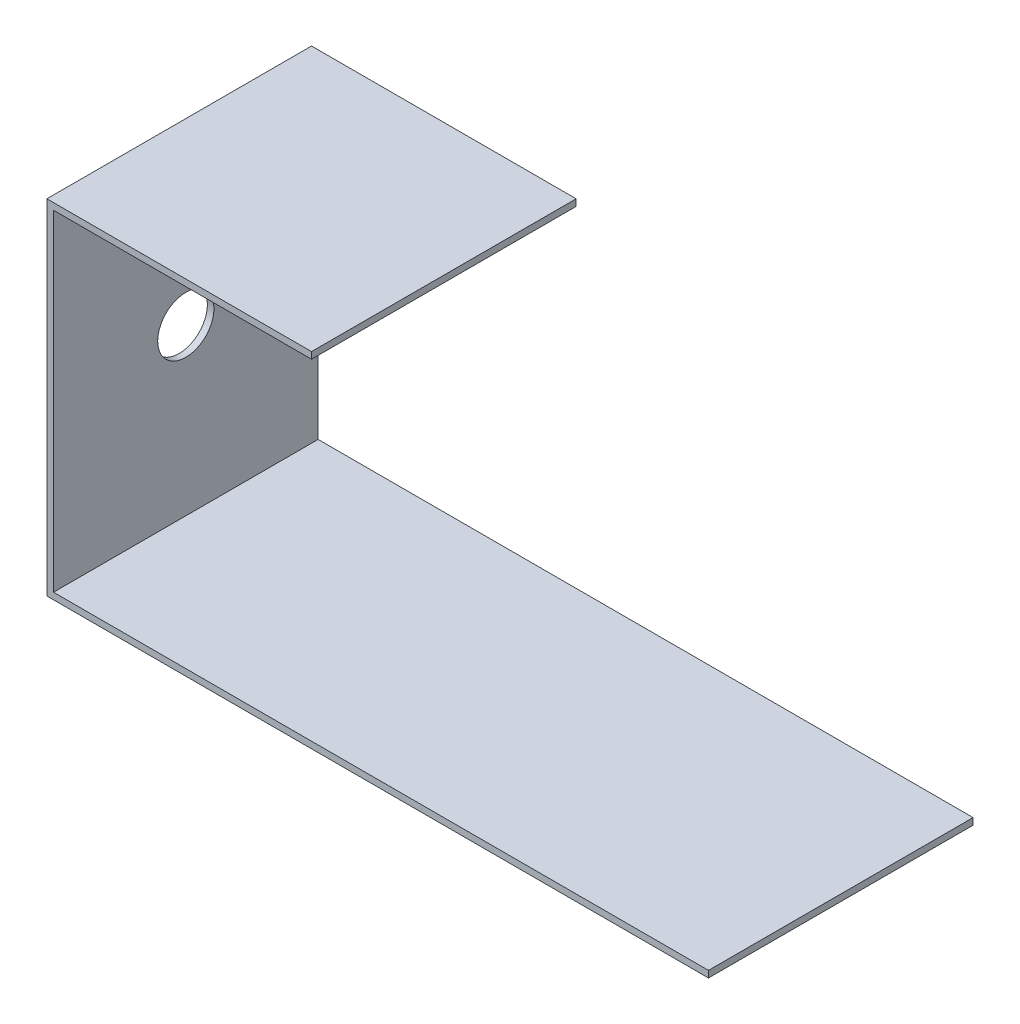
ISO-10303-21;
HEADER;
FILE_DESCRIPTION(('STEP AP214'),'2;1');
FILE_NAME('part.step','',(''),(''),'','','');
FILE_SCHEMA(('AUTOMOTIVE_DESIGN { 1 0 10303 214 1 1 1 1 }'));
ENDSEC;
DATA;
#1=APPLICATION_CONTEXT('core data for automotive mechanical design processes');
#2=APPLICATION_PROTOCOL_DEFINITION('international standard','automotive_design',2000,#1);
#3=PRODUCT_CONTEXT('',#1,'mechanical');
#4=PRODUCT('Part','Part','',(#3));
#5=PRODUCT_RELATED_PRODUCT_CATEGORY('part','',(#4));
#6=PRODUCT_DEFINITION_FORMATION('','',#4);
#7=PRODUCT_DEFINITION_CONTEXT('part definition',#1,'design');
#8=PRODUCT_DEFINITION('design','',#6,#7);
#9=PRODUCT_DEFINITION_SHAPE('','',#8);
#10=(LENGTH_UNIT() NAMED_UNIT(*) SI_UNIT(.MILLI.,.METRE.));
#11=(NAMED_UNIT(*) PLANE_ANGLE_UNIT() SI_UNIT($,.RADIAN.));
#12=(NAMED_UNIT(*) SI_UNIT($,.STERADIAN.) SOLID_ANGLE_UNIT());
#13=UNCERTAINTY_MEASURE_WITH_UNIT(LENGTH_MEASURE(1.E-05),#10,'distance_accuracy_value','');
#14=(GEOMETRIC_REPRESENTATION_CONTEXT(3) GLOBAL_UNCERTAINTY_ASSIGNED_CONTEXT((#13)) GLOBAL_UNIT_ASSIGNED_CONTEXT((#10,
#11,#12)) REPRESENTATION_CONTEXT('',''));
#15=CARTESIAN_POINT('',(0.,0.,0.));
#16=DIRECTION('',(0.,0.,1.));
#17=DIRECTION('',(1.,0.,0.));
#18=AXIS2_PLACEMENT_3D('',#15,#16,#17);
#19=CARTESIAN_POINT('',(0.,-52.,40.));
#20=DIRECTION('',(1.,0.,0.));
#21=DIRECTION('',(0.,0.,-1.));
#22=AXIS2_PLACEMENT_3D('',#19,#20,#21);
#23=PLANE('',#22);
#24=CARTESIAN_POINT('',(0.,-26.,20.));
#25=DIRECTION('',(-1.,0.,0.));
#26=DIRECTION('',(0.,0.,1.));
#27=AXIS2_PLACEMENT_3D('',#24,#25,#26);
#28=CIRCLE('',#27,4.25);
#29=CARTESIAN_POINT('',(0.,-26.,24.25));
#30=VERTEX_POINT('',#29);
#31=EDGE_CURVE('E206',#30,#30,#28,.T.);
#32=ORIENTED_EDGE('',*,*,#31,.F.);
#33=EDGE_LOOP('',(#32));
#34=FACE_BOUND('',#33,.T.);
#35=DIRECTION('',(0.,-1.,0.));
#36=VECTOR('',#35,1.);
#37=CARTESIAN_POINT('',(0.,-52.,0.));
#38=LINE('',#37,#36);
#39=CARTESIAN_POINT('',(0.,0.,0.));
#40=VERTEX_POINT('',#39);
#41=CARTESIAN_POINT('',(0.,-52.,0.));
#42=VERTEX_POINT('',#41);
#43=EDGE_CURVE('E139',#40,#42,#38,.T.);
#44=ORIENTED_EDGE('',*,*,#43,.T.);
#45=DIRECTION('',(0.,0.,-1.));
#46=VECTOR('',#45,1.);
#47=CARTESIAN_POINT('',(0.,-52.,40.));
#48=LINE('',#47,#46);
#49=CARTESIAN_POINT('',(0.,-52.,40.));
#50=VERTEX_POINT('',#49);
#51=EDGE_CURVE('E11',#50,#42,#48,.T.);
#52=ORIENTED_EDGE('',*,*,#51,.F.);
#53=DIRECTION('',(0.,-1.,0.));
#54=VECTOR('',#53,1.);
#55=CARTESIAN_POINT('',(0.,-52.,40.));
#56=LINE('',#55,#54);
#57=CARTESIAN_POINT('',(0.,0.,40.));
#58=VERTEX_POINT('',#57);
#59=EDGE_CURVE('E162',#58,#50,#56,.T.);
#60=ORIENTED_EDGE('',*,*,#59,.F.);
#61=DIRECTION('',(0.,0.,-1.));
#62=VECTOR('',#61,1.);
#63=CARTESIAN_POINT('',(0.,0.,40.));
#64=LINE('',#63,#62);
#65=EDGE_CURVE('E135',#58,#40,#64,.T.);
#66=ORIENTED_EDGE('',*,*,#65,.T.);
#67=EDGE_LOOP('',(#44,#52,#60,#66));
#68=FACE_BOUND('',#67,.T.);
#69=ADVANCED_FACE('F38',(#34,#68),#23,.F.);
#70=CARTESIAN_POINT('',(100.,-52.,40.));
#71=DIRECTION('',(0.,1.,0.));
#72=DIRECTION('',(-1.,0.,0.));
#73=AXIS2_PLACEMENT_3D('',#70,#71,#72);
#74=PLANE('',#73);
#75=DIRECTION('',(1.,0.,0.));
#76=VECTOR('',#75,1.);
#77=CARTESIAN_POINT('',(100.,-52.,0.));
#78=LINE('',#77,#76);
#79=CARTESIAN_POINT('',(100.,-52.,0.));
#80=VERTEX_POINT('',#79);
#81=EDGE_CURVE('E143',#42,#80,#78,.T.);
#82=ORIENTED_EDGE('',*,*,#81,.T.);
#83=DIRECTION('',(0.,0.,-1.));
#84=VECTOR('',#83,1.);
#85=CARTESIAN_POINT('',(100.,-52.,40.));
#86=LINE('',#85,#84);
#87=CARTESIAN_POINT('',(100.,-52.,40.));
#88=VERTEX_POINT('',#87);
#89=EDGE_CURVE('E47',#88,#80,#86,.T.);
#90=ORIENTED_EDGE('',*,*,#89,.F.);
#91=DIRECTION('',(1.,0.,0.));
#92=VECTOR('',#91,1.);
#93=CARTESIAN_POINT('',(100.,-52.,40.));
#94=LINE('',#93,#92);
#95=EDGE_CURVE('E98',#50,#88,#94,.T.);
#96=ORIENTED_EDGE('',*,*,#95,.F.);
#97=ORIENTED_EDGE('',*,*,#51,.T.);
#98=EDGE_LOOP('',(#82,#90,#96,#97));
#99=FACE_BOUND('',#98,.T.);
#100=ADVANCED_FACE('F223',(#99),#74,.F.);
#101=CARTESIAN_POINT('',(100.,-51.,40.));
#102=DIRECTION('',(-1.,0.,0.));
#103=DIRECTION('',(0.,0.,1.));
#104=AXIS2_PLACEMENT_3D('',#101,#102,#103);
#105=PLANE('',#104);
#106=DIRECTION('',(0.,1.,0.));
#107=VECTOR('',#106,1.);
#108=CARTESIAN_POINT('',(100.,-51.,0.));
#109=LINE('',#108,#107);
#110=CARTESIAN_POINT('',(100.,-51.,0.));
#111=VERTEX_POINT('',#110);
#112=EDGE_CURVE('E147',#80,#111,#109,.T.);
#113=ORIENTED_EDGE('',*,*,#112,.T.);
#114=DIRECTION('',(0.,0.,-1.));
#115=VECTOR('',#114,1.);
#116=CARTESIAN_POINT('',(100.,-51.,40.));
#117=LINE('',#116,#115);
#118=CARTESIAN_POINT('',(100.,-51.,40.));
#119=VERTEX_POINT('',#118);
#120=EDGE_CURVE('E173',#119,#111,#117,.T.);
#121=ORIENTED_EDGE('',*,*,#120,.F.);
#122=DIRECTION('',(0.,1.,0.));
#123=VECTOR('',#122,1.);
#124=CARTESIAN_POINT('',(100.,-51.,40.));
#125=LINE('',#124,#123);
#126=EDGE_CURVE('E183',#88,#119,#125,.T.);
#127=ORIENTED_EDGE('',*,*,#126,.F.);
#128=ORIENTED_EDGE('',*,*,#89,.T.);
#129=EDGE_LOOP('',(#113,#121,#127,#128));
#130=FACE_BOUND('',#129,.T.);
#131=ADVANCED_FACE('F181',(#130),#105,.F.);
#132=CARTESIAN_POINT('',(1.00000000000001,-51.,40.));
#133=DIRECTION('',(0.,-1.,0.));
#134=DIRECTION('',(0.,0.,-1.));
#135=AXIS2_PLACEMENT_3D('',#132,#133,#134);
#136=PLANE('',#135);
#137=DIRECTION('',(-1.,0.,0.));
#138=VECTOR('',#137,1.);
#139=CARTESIAN_POINT('',(1.00000000000001,-51.,0.));
#140=LINE('',#139,#138);
#141=CARTESIAN_POINT('',(1.00000000000001,-51.,0.));
#142=VERTEX_POINT('',#141);
#143=EDGE_CURVE('E150',#111,#142,#140,.T.);
#144=ORIENTED_EDGE('',*,*,#143,.T.);
#145=DIRECTION('',(0.,0.,-1.));
#146=VECTOR('',#145,1.);
#147=CARTESIAN_POINT('',(1.00000000000001,-51.,40.));
#148=LINE('',#147,#146);
#149=CARTESIAN_POINT('',(1.00000000000001,-51.,40.));
#150=VERTEX_POINT('',#149);
#151=EDGE_CURVE('E169',#150,#142,#148,.T.);
#152=ORIENTED_EDGE('',*,*,#151,.F.);
#153=DIRECTION('',(-1.,0.,0.));
#154=VECTOR('',#153,1.);
#155=CARTESIAN_POINT('',(1.00000000000001,-51.,40.));
#156=LINE('',#155,#154);
#157=EDGE_CURVE('E196',#119,#150,#156,.T.);
#158=ORIENTED_EDGE('',*,*,#157,.F.);
#159=ORIENTED_EDGE('',*,*,#120,.T.);
#160=EDGE_LOOP('',(#144,#152,#158,#159));
#161=FACE_BOUND('',#160,.T.);
#162=ADVANCED_FACE('F191',(#161),#136,.F.);
#163=CARTESIAN_POINT('',(0.999999999999997,-1.,40.));
#164=DIRECTION('',(-1.,0.,0.));
#165=DIRECTION('',(0.,-1.,0.));
#166=AXIS2_PLACEMENT_3D('',#163,#164,#165);
#167=PLANE('',#166);
#168=CARTESIAN_POINT('',(1.,-26.,20.));
#169=DIRECTION('',(-1.,0.,0.));
#170=DIRECTION('',(0.,0.,1.));
#171=AXIS2_PLACEMENT_3D('',#168,#169,#170);
#172=CIRCLE('',#171,4.25);
#173=CARTESIAN_POINT('',(1.,-26.,24.25));
#174=VERTEX_POINT('',#173);
#175=EDGE_CURVE('E144',#174,#174,#172,.T.);
#176=ORIENTED_EDGE('',*,*,#175,.T.);
#177=EDGE_LOOP('',(#176));
#178=FACE_BOUND('',#177,.T.);
#179=DIRECTION('',(0.,1.,0.));
#180=VECTOR('',#179,1.);
#181=CARTESIAN_POINT('',(0.999999999999997,-1.,0.));
#182=LINE('',#181,#180);
#183=CARTESIAN_POINT('',(0.999999999999997,-1.,0.));
#184=VERTEX_POINT('',#183);
#185=EDGE_CURVE('E153',#142,#184,#182,.T.);
#186=ORIENTED_EDGE('',*,*,#185,.T.);
#187=DIRECTION('',(0.,0.,-1.));
#188=VECTOR('',#187,1.);
#189=CARTESIAN_POINT('',(0.999999999999997,-1.,40.));
#190=LINE('',#189,#188);
#191=CARTESIAN_POINT('',(0.999999999999997,-1.,40.));
#192=VERTEX_POINT('',#191);
#193=EDGE_CURVE('E128',#192,#184,#190,.T.);
#194=ORIENTED_EDGE('',*,*,#193,.F.);
#195=DIRECTION('',(0.,1.,0.));
#196=VECTOR('',#195,1.);
#197=CARTESIAN_POINT('',(0.999999999999997,-1.,40.));
#198=LINE('',#197,#196);
#199=EDGE_CURVE('E117',#150,#192,#198,.T.);
#200=ORIENTED_EDGE('',*,*,#199,.F.);
#201=ORIENTED_EDGE('',*,*,#151,.T.);
#202=EDGE_LOOP('',(#186,#194,#200,#201));
#203=FACE_BOUND('',#202,.T.);
#204=ADVANCED_FACE('F194',(#178,#203),#167,.F.);
#205=CARTESIAN_POINT('',(40.,-1.,40.));
#206=DIRECTION('',(0.,1.,0.));
#207=DIRECTION('',(-1.,0.,0.));
#208=AXIS2_PLACEMENT_3D('',#205,#206,#207);
#209=PLANE('',#208);
#210=DIRECTION('',(1.,0.,0.));
#211=VECTOR('',#210,1.);
#212=CARTESIAN_POINT('',(40.,-1.,0.));
#213=LINE('',#212,#211);
#214=CARTESIAN_POINT('',(40.,-1.,0.));
#215=VERTEX_POINT('',#214);
#216=EDGE_CURVE('E126',#184,#215,#213,.T.);
#217=ORIENTED_EDGE('',*,*,#216,.T.);
#218=DIRECTION('',(0.,0.,-1.));
#219=VECTOR('',#218,1.);
#220=CARTESIAN_POINT('',(40.,-1.,40.));
#221=LINE('',#220,#219);
#222=CARTESIAN_POINT('',(40.,-1.,40.));
#223=VERTEX_POINT('',#222);
#224=EDGE_CURVE('E123',#223,#215,#221,.T.);
#225=ORIENTED_EDGE('',*,*,#224,.F.);
#226=DIRECTION('',(1.,0.,0.));
#227=VECTOR('',#226,1.);
#228=CARTESIAN_POINT('',(40.,-1.,40.));
#229=LINE('',#228,#227);
#230=EDGE_CURVE('E111',#192,#223,#229,.T.);
#231=ORIENTED_EDGE('',*,*,#230,.F.);
#232=ORIENTED_EDGE('',*,*,#193,.T.);
#233=EDGE_LOOP('',(#217,#225,#231,#232));
#234=FACE_BOUND('',#233,.T.);
#235=ADVANCED_FACE('F124',(#234),#209,.F.);
#236=CARTESIAN_POINT('',(40.,0.,40.));
#237=DIRECTION('',(-1.,0.,0.));
#238=DIRECTION('',(0.,0.,1.));
#239=AXIS2_PLACEMENT_3D('',#236,#237,#238);
#240=PLANE('',#239);
#241=DIRECTION('',(0.,1.,0.));
#242=VECTOR('',#241,1.);
#243=CARTESIAN_POINT('',(40.,0.,0.));
#244=LINE('',#243,#242);
#245=CARTESIAN_POINT('',(40.,0.,0.));
#246=VERTEX_POINT('',#245);
#247=EDGE_CURVE('E84',#215,#246,#244,.T.);
#248=ORIENTED_EDGE('',*,*,#247,.T.);
#249=DIRECTION('',(0.,0.,-1.));
#250=VECTOR('',#249,1.);
#251=CARTESIAN_POINT('',(40.,0.,40.));
#252=LINE('',#251,#250);
#253=CARTESIAN_POINT('',(40.,0.,40.));
#254=VERTEX_POINT('',#253);
#255=EDGE_CURVE('E129',#254,#246,#252,.T.);
#256=ORIENTED_EDGE('',*,*,#255,.F.);
#257=DIRECTION('',(0.,1.,0.));
#258=VECTOR('',#257,1.);
#259=CARTESIAN_POINT('',(40.,0.,40.));
#260=LINE('',#259,#258);
#261=EDGE_CURVE('E115',#223,#254,#260,.T.);
#262=ORIENTED_EDGE('',*,*,#261,.F.);
#263=ORIENTED_EDGE('',*,*,#224,.T.);
#264=EDGE_LOOP('',(#248,#256,#262,#263));
#265=FACE_BOUND('',#264,.T.);
#266=ADVANCED_FACE('F131',(#265),#240,.F.);
#267=CARTESIAN_POINT('',(0.,0.,40.));
#268=DIRECTION('',(0.,-1.,0.));
#269=DIRECTION('',(0.,0.,-1.));
#270=AXIS2_PLACEMENT_3D('',#267,#268,#269);
#271=PLANE('',#270);
#272=DIRECTION('',(-1.,0.,0.));
#273=VECTOR('',#272,1.);
#274=CARTESIAN_POINT('',(0.,0.,0.));
#275=LINE('',#274,#273);
#276=EDGE_CURVE('E90',#246,#40,#275,.T.);
#277=ORIENTED_EDGE('',*,*,#276,.T.);
#278=ORIENTED_EDGE('',*,*,#65,.F.);
#279=DIRECTION('',(-1.,0.,0.));
#280=VECTOR('',#279,1.);
#281=CARTESIAN_POINT('',(0.,0.,40.));
#282=LINE('',#281,#280);
#283=EDGE_CURVE('E55',#254,#58,#282,.T.);
#284=ORIENTED_EDGE('',*,*,#283,.F.);
#285=ORIENTED_EDGE('',*,*,#255,.T.);
#286=EDGE_LOOP('',(#277,#278,#284,#285));
#287=FACE_BOUND('',#286,.T.);
#288=ADVANCED_FACE('F226',(#287),#271,.F.);
#289=CARTESIAN_POINT('',(0.,0.,40.));
#290=DIRECTION('',(0.,0.,-1.));
#291=DIRECTION('',(-1.,0.,0.));
#292=AXIS2_PLACEMENT_3D('',#289,#290,#291);
#293=PLANE('',#292);
#294=ORIENTED_EDGE('',*,*,#59,.T.);
#295=ORIENTED_EDGE('',*,*,#95,.T.);
#296=ORIENTED_EDGE('',*,*,#126,.T.);
#297=ORIENTED_EDGE('',*,*,#157,.T.);
#298=ORIENTED_EDGE('',*,*,#199,.T.);
#299=ORIENTED_EDGE('',*,*,#230,.T.);
#300=ORIENTED_EDGE('',*,*,#261,.T.);
#301=ORIENTED_EDGE('',*,*,#283,.T.);
#302=EDGE_LOOP('',(#294,#295,#296,#297,#298,#299,#300,#301));
#303=FACE_BOUND('',#302,.T.);
#304=ADVANCED_FACE('F113',(#303),#293,.F.);
#305=CARTESIAN_POINT('',(0.,0.,0.));
#306=DIRECTION('',(0.,0.,-1.));
#307=DIRECTION('',(-1.,0.,0.));
#308=AXIS2_PLACEMENT_3D('',#305,#306,#307);
#309=PLANE('',#308);
#310=ORIENTED_EDGE('',*,*,#43,.F.);
#311=ORIENTED_EDGE('',*,*,#276,.F.);
#312=ORIENTED_EDGE('',*,*,#247,.F.);
#313=ORIENTED_EDGE('',*,*,#216,.F.);
#314=ORIENTED_EDGE('',*,*,#185,.F.);
#315=ORIENTED_EDGE('',*,*,#143,.F.);
#316=ORIENTED_EDGE('',*,*,#112,.F.);
#317=ORIENTED_EDGE('',*,*,#81,.F.);
#318=EDGE_LOOP('',(#310,#311,#312,#313,#314,#315,#316,#317));
#319=FACE_BOUND('',#318,.T.);
#320=ADVANCED_FACE('F187',(#319),#309,.T.);
#321=CARTESIAN_POINT('',(1.,-26.,20.));
#322=DIRECTION('',(-1.,0.,0.));
#323=DIRECTION('',(0.,0.,1.));
#324=AXIS2_PLACEMENT_3D('',#321,#322,#323);
#325=CYLINDRICAL_SURFACE('',#324,4.25);
#326=ORIENTED_EDGE('',*,*,#175,.F.);
#327=EDGE_LOOP('',(#326));
#328=FACE_BOUND('',#327,.T.);
#329=ORIENTED_EDGE('',*,*,#31,.T.);
#330=EDGE_LOOP('',(#329));
#331=FACE_BOUND('',#330,.T.);
#332=ADVANCED_FACE('F215',(#328,#331),#325,.F.);
#333=CLOSED_SHELL('',(#69,#100,#131,#162,#204,#235,#266,#288,#304,#320,#332));
#334=MANIFOLD_SOLID_BREP('B2',#333);
#335=ADVANCED_BREP_SHAPE_REPRESENTATION('',(#18,#334),#14);
#336=SHAPE_DEFINITION_REPRESENTATION(#9,#335);
ENDSEC;
END-ISO-10303-21;
